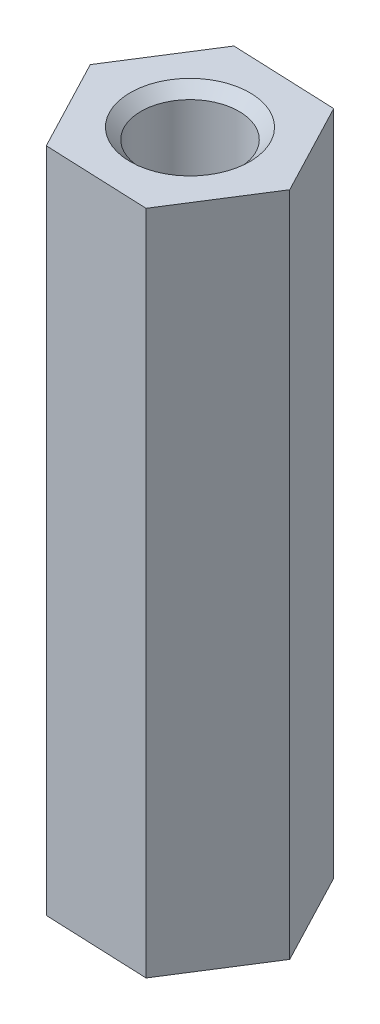
ISO-10303-21;
HEADER;
FILE_DESCRIPTION(('STEP AP214'),'2;1');
FILE_NAME('part.step','',(''),(''),'','','');
FILE_SCHEMA(('AUTOMOTIVE_DESIGN { 1 0 10303 214 1 1 1 1 }'));
ENDSEC;
DATA;
#1=APPLICATION_CONTEXT('core data for automotive mechanical design processes');
#2=APPLICATION_PROTOCOL_DEFINITION('international standard','automotive_design',2000,#1);
#3=PRODUCT_CONTEXT('',#1,'mechanical');
#4=PRODUCT('Part','Part','',(#3));
#5=PRODUCT_RELATED_PRODUCT_CATEGORY('part','',(#4));
#6=PRODUCT_DEFINITION_FORMATION('','',#4);
#7=PRODUCT_DEFINITION_CONTEXT('part definition',#1,'design');
#8=PRODUCT_DEFINITION('design','',#6,#7);
#9=PRODUCT_DEFINITION_SHAPE('','',#8);
#10=(LENGTH_UNIT() NAMED_UNIT(*) SI_UNIT(.MILLI.,.METRE.));
#11=(NAMED_UNIT(*) PLANE_ANGLE_UNIT() SI_UNIT($,.RADIAN.));
#12=(NAMED_UNIT(*) SI_UNIT($,.STERADIAN.) SOLID_ANGLE_UNIT());
#13=UNCERTAINTY_MEASURE_WITH_UNIT(LENGTH_MEASURE(1.E-05),#10,'distance_accuracy_value','');
#14=(GEOMETRIC_REPRESENTATION_CONTEXT(3) GLOBAL_UNCERTAINTY_ASSIGNED_CONTEXT((#13)) GLOBAL_UNIT_ASSIGNED_CONTEXT((#10,
#11,#12)) REPRESENTATION_CONTEXT('',''));
#15=CARTESIAN_POINT('',(0.,0.,0.));
#16=DIRECTION('',(0.,0.,1.));
#17=DIRECTION('',(1.,0.,0.));
#18=AXIS2_PLACEMENT_3D('',#15,#16,#17);
#19=CARTESIAN_POINT('',(0.,17.,0.));
#20=DIRECTION('',(0.,1.,0.));
#21=DIRECTION('',(0.,0.,1.));
#22=AXIS2_PLACEMENT_3D('',#19,#20,#21);
#23=PLANE('',#22);
#24=CARTESIAN_POINT('',(0.,17.,0.));
#25=DIRECTION('',(0.,1.,0.));
#26=DIRECTION('',(0.,0.,1.));
#27=AXIS2_PLACEMENT_3D('',#24,#25,#26);
#28=CIRCLE('',#27,1.525);
#29=CARTESIAN_POINT('',(0.,17.,1.525));
#30=VERTEX_POINT('',#29);
#31=EDGE_CURVE('E197',#30,#30,#28,.T.);
#32=ORIENTED_EDGE('',*,*,#31,.F.);
#33=EDGE_LOOP('',(#32));
#34=FACE_BOUND('',#33,.T.);
#35=DIRECTION('',(0.999145776971958,0.,0.0413245249107971));
#36=VECTOR('',#35,1.);
#37=CARTESIAN_POINT('',(-1.42181769887204,17.,2.24316021819832));
#38=LINE('',#37,#36);
#39=CARTESIAN_POINT('',(-1.42181769887204,17.,2.24316021819832));
#40=VERTEX_POINT('',#39);
#41=CARTESIAN_POINT('',(1.23172488428237,17.,2.35291035587268));
#42=VERTEX_POINT('',#41);
#43=EDGE_CURVE('E149',#40,#42,#38,.T.);
#44=ORIENTED_EDGE('',*,*,#43,.T.);
#45=DIRECTION('',(0.535360976858052,0.,-0.844623362486258));
#46=VECTOR('',#45,1.);
#47=CARTESIAN_POINT('',(1.23172488428237,17.,2.35291035587268));
#48=LINE('',#47,#46);
#49=CARTESIAN_POINT('',(2.65354258315441,17.,0.109750137674357));
#50=VERTEX_POINT('',#49);
#51=EDGE_CURVE('E98',#42,#50,#48,.T.);
#52=ORIENTED_EDGE('',*,*,#51,.T.);
#53=DIRECTION('',(-0.463784800113906,0.,-0.885947887397055));
#54=VECTOR('',#53,1.);
#55=CARTESIAN_POINT('',(2.65354258315441,17.,0.109750137674357));
#56=LINE('',#55,#54);
#57=CARTESIAN_POINT('',(1.42181769887204,17.,-2.24316021819832));
#58=VERTEX_POINT('',#57);
#59=EDGE_CURVE('E110',#50,#58,#56,.T.);
#60=ORIENTED_EDGE('',*,*,#59,.T.);
#61=DIRECTION('',(-0.999145776971957,0.,-0.0413245249107969));
#62=VECTOR('',#61,1.);
#63=CARTESIAN_POINT('',(1.42181769887204,17.,-2.24316021819832));
#64=LINE('',#63,#62);
#65=CARTESIAN_POINT('',(-1.23172488428237,17.,-2.35291035587268));
#66=VERTEX_POINT('',#65);
#67=EDGE_CURVE('E105',#58,#66,#64,.T.);
#68=ORIENTED_EDGE('',*,*,#67,.T.);
#69=DIRECTION('',(-0.535360976858052,0.,0.844623362486258));
#70=VECTOR('',#69,1.);
#71=CARTESIAN_POINT('',(-1.23172488428237,17.,-2.35291035587268));
#72=LINE('',#71,#70);
#73=CARTESIAN_POINT('',(-2.65354258315441,17.,-0.109750137674357));
#74=VERTEX_POINT('',#73);
#75=EDGE_CURVE('E108',#66,#74,#72,.T.);
#76=ORIENTED_EDGE('',*,*,#75,.T.);
#77=DIRECTION('',(0.463784800113906,0.,0.885947887397055));
#78=VECTOR('',#77,1.);
#79=CARTESIAN_POINT('',(-2.65354258315441,17.,-0.109750137674357));
#80=LINE('',#79,#78);
#81=EDGE_CURVE('E61',#74,#40,#80,.T.);
#82=ORIENTED_EDGE('',*,*,#81,.T.);
#83=EDGE_LOOP('',(#44,#52,#60,#68,#76,#82));
#84=FACE_BOUND('',#83,.T.);
#85=ADVANCED_FACE('F43',(#34,#84),#23,.T.);
#86=CARTESIAN_POINT('',(0.,0.,0.));
#87=DIRECTION('',(0.,1.,0.));
#88=DIRECTION('',(0.,0.,1.));
#89=AXIS2_PLACEMENT_3D('',#86,#87,#88);
#90=PLANE('',#89);
#91=CARTESIAN_POINT('',(0.,0.,0.));
#92=DIRECTION('',(0.,1.,0.));
#93=DIRECTION('',(0.,0.,1.));
#94=AXIS2_PLACEMENT_3D('',#91,#92,#93);
#95=CIRCLE('',#94,1.25);
#96=CARTESIAN_POINT('',(0.,0.,1.25));
#97=VERTEX_POINT('',#96);
#98=EDGE_CURVE('E137',#97,#97,#95,.T.);
#99=ORIENTED_EDGE('',*,*,#98,.T.);
#100=EDGE_LOOP('',(#99));
#101=FACE_BOUND('',#100,.T.);
#102=DIRECTION('',(0.999145776971958,0.,0.0413245249107971));
#103=VECTOR('',#102,1.);
#104=CARTESIAN_POINT('',(-1.42181769887204,0.,2.24316021819832));
#105=LINE('',#104,#103);
#106=CARTESIAN_POINT('',(-1.42181769887204,0.,2.24316021819832));
#107=VERTEX_POINT('',#106);
#108=CARTESIAN_POINT('',(1.23172488428237,0.,2.35291035587268));
#109=VERTEX_POINT('',#108);
#110=EDGE_CURVE('E132',#107,#109,#105,.T.);
#111=ORIENTED_EDGE('',*,*,#110,.F.);
#112=DIRECTION('',(0.463784800113906,0.,0.885947887397055));
#113=VECTOR('',#112,1.);
#114=CARTESIAN_POINT('',(-2.65354258315441,0.,-0.109750137674357));
#115=LINE('',#114,#113);
#116=CARTESIAN_POINT('',(-2.65354258315441,0.,-0.109750137674357));
#117=VERTEX_POINT('',#116);
#118=EDGE_CURVE('E90',#117,#107,#115,.T.);
#119=ORIENTED_EDGE('',*,*,#118,.F.);
#120=DIRECTION('',(-0.535360976858052,0.,0.844623362486258));
#121=VECTOR('',#120,1.);
#122=CARTESIAN_POINT('',(-1.23172488428237,0.,-2.35291035587268));
#123=LINE('',#122,#121);
#124=CARTESIAN_POINT('',(-1.23172488428237,0.,-2.35291035587268));
#125=VERTEX_POINT('',#124);
#126=EDGE_CURVE('E84',#125,#117,#123,.T.);
#127=ORIENTED_EDGE('',*,*,#126,.F.);
#128=DIRECTION('',(-0.999145776971957,0.,-0.0413245249107969));
#129=VECTOR('',#128,1.);
#130=CARTESIAN_POINT('',(1.42181769887204,0.,-2.24316021819832));
#131=LINE('',#130,#129);
#132=CARTESIAN_POINT('',(1.42181769887204,0.,-2.24316021819832));
#133=VERTEX_POINT('',#132);
#134=EDGE_CURVE('E119',#133,#125,#131,.T.);
#135=ORIENTED_EDGE('',*,*,#134,.F.);
#136=DIRECTION('',(-0.463784800113906,0.,-0.885947887397055));
#137=VECTOR('',#136,1.);
#138=CARTESIAN_POINT('',(2.65354258315441,0.,0.109750137674357));
#139=LINE('',#138,#137);
#140=CARTESIAN_POINT('',(2.65354258315441,0.,0.109750137674357));
#141=VERTEX_POINT('',#140);
#142=EDGE_CURVE('E140',#141,#133,#139,.T.);
#143=ORIENTED_EDGE('',*,*,#142,.F.);
#144=DIRECTION('',(0.535360976858052,0.,-0.844623362486258));
#145=VECTOR('',#144,1.);
#146=CARTESIAN_POINT('',(1.23172488428237,0.,2.35291035587268));
#147=LINE('',#146,#145);
#148=EDGE_CURVE('E136',#109,#141,#147,.T.);
#149=ORIENTED_EDGE('',*,*,#148,.F.);
#150=EDGE_LOOP('',(#111,#119,#127,#135,#143,#149));
#151=FACE_BOUND('',#150,.T.);
#152=ADVANCED_FACE('F162',(#101,#151),#90,.F.);
#153=CARTESIAN_POINT('',(-1.42181769887204,17.,2.24316021819832));
#154=DIRECTION('',(0.0413245249107971,0.,-0.999145776971958));
#155=DIRECTION('',(-0.999145776971958,0.,-0.0413245249107971));
#156=AXIS2_PLACEMENT_3D('',#153,#154,#155);
#157=PLANE('',#156);
#158=ORIENTED_EDGE('',*,*,#110,.T.);
#159=DIRECTION('',(0.,-1.,0.));
#160=VECTOR('',#159,1.);
#161=CARTESIAN_POINT('',(1.23172488428237,17.,2.35291035587268));
#162=LINE('',#161,#160);
#163=EDGE_CURVE('E11',#42,#109,#162,.T.);
#164=ORIENTED_EDGE('',*,*,#163,.F.);
#165=ORIENTED_EDGE('',*,*,#43,.F.);
#166=DIRECTION('',(0.,-1.,0.));
#167=VECTOR('',#166,1.);
#168=CARTESIAN_POINT('',(-1.42181769887204,17.,2.24316021819832));
#169=LINE('',#168,#167);
#170=EDGE_CURVE('E128',#40,#107,#169,.T.);
#171=ORIENTED_EDGE('',*,*,#170,.T.);
#172=EDGE_LOOP('',(#158,#164,#165,#171));
#173=FACE_BOUND('',#172,.T.);
#174=ADVANCED_FACE('F45',(#173),#157,.F.);
#175=CARTESIAN_POINT('',(1.23172488428237,17.,2.35291035587268));
#176=DIRECTION('',(-0.844623362486258,0.,-0.535360976858052));
#177=DIRECTION('',(-0.535360976858052,0.,0.844623362486258));
#178=AXIS2_PLACEMENT_3D('',#175,#176,#177);
#179=PLANE('',#178);
#180=ORIENTED_EDGE('',*,*,#148,.T.);
#181=DIRECTION('',(0.,-1.,0.));
#182=VECTOR('',#181,1.);
#183=CARTESIAN_POINT('',(2.65354258315441,17.,0.109750137674357));
#184=LINE('',#183,#182);
#185=EDGE_CURVE('E53',#50,#141,#184,.T.);
#186=ORIENTED_EDGE('',*,*,#185,.F.);
#187=ORIENTED_EDGE('',*,*,#51,.F.);
#188=ORIENTED_EDGE('',*,*,#163,.T.);
#189=EDGE_LOOP('',(#180,#186,#187,#188));
#190=FACE_BOUND('',#189,.T.);
#191=ADVANCED_FACE('F263',(#190),#179,.F.);
#192=CARTESIAN_POINT('',(2.65354258315441,17.,0.109750137674357));
#193=DIRECTION('',(-0.885947887397055,0.,0.463784800113906));
#194=DIRECTION('',(0.463784800113906,0.,0.885947887397055));
#195=AXIS2_PLACEMENT_3D('',#192,#193,#194);
#196=PLANE('',#195);
#197=ORIENTED_EDGE('',*,*,#142,.T.);
#198=DIRECTION('',(0.,-1.,0.));
#199=VECTOR('',#198,1.);
#200=CARTESIAN_POINT('',(1.42181769887204,17.,-2.24316021819832));
#201=LINE('',#200,#199);
#202=EDGE_CURVE('E121',#58,#133,#201,.T.);
#203=ORIENTED_EDGE('',*,*,#202,.F.);
#204=ORIENTED_EDGE('',*,*,#59,.F.);
#205=ORIENTED_EDGE('',*,*,#185,.T.);
#206=EDGE_LOOP('',(#197,#203,#204,#205));
#207=FACE_BOUND('',#206,.T.);
#208=ADVANCED_FACE('F159',(#207),#196,.F.);
#209=CARTESIAN_POINT('',(1.42181769887204,17.,-2.24316021819832));
#210=DIRECTION('',(-0.0413245249107969,0.,0.999145776971958));
#211=DIRECTION('',(0.999145776971958,0.,0.041324524910797));
#212=AXIS2_PLACEMENT_3D('',#209,#210,#211);
#213=PLANE('',#212);
#214=ORIENTED_EDGE('',*,*,#134,.T.);
#215=DIRECTION('',(0.,-1.,0.));
#216=VECTOR('',#215,1.);
#217=CARTESIAN_POINT('',(-1.23172488428237,17.,-2.35291035587268));
#218=LINE('',#217,#216);
#219=EDGE_CURVE('E116',#66,#125,#218,.T.);
#220=ORIENTED_EDGE('',*,*,#219,.F.);
#221=ORIENTED_EDGE('',*,*,#67,.F.);
#222=ORIENTED_EDGE('',*,*,#202,.T.);
#223=EDGE_LOOP('',(#214,#220,#221,#222));
#224=FACE_BOUND('',#223,.T.);
#225=ADVANCED_FACE('F117',(#224),#213,.F.);
#226=CARTESIAN_POINT('',(-1.23172488428237,17.,-2.35291035587268));
#227=DIRECTION('',(0.844623362486258,0.,0.535360976858052));
#228=DIRECTION('',(0.535360976858052,0.,-0.844623362486258));
#229=AXIS2_PLACEMENT_3D('',#226,#227,#228);
#230=PLANE('',#229);
#231=ORIENTED_EDGE('',*,*,#126,.T.);
#232=DIRECTION('',(0.,-1.,0.));
#233=VECTOR('',#232,1.);
#234=CARTESIAN_POINT('',(-2.65354258315441,17.,-0.109750137674357));
#235=LINE('',#234,#233);
#236=EDGE_CURVE('E122',#74,#117,#235,.T.);
#237=ORIENTED_EDGE('',*,*,#236,.F.);
#238=ORIENTED_EDGE('',*,*,#75,.F.);
#239=ORIENTED_EDGE('',*,*,#219,.T.);
#240=EDGE_LOOP('',(#231,#237,#238,#239));
#241=FACE_BOUND('',#240,.T.);
#242=ADVANCED_FACE('F124',(#241),#230,.F.);
#243=CARTESIAN_POINT('',(-2.65354258315441,17.,-0.109750137674357));
#244=DIRECTION('',(0.885947887397055,0.,-0.463784800113906));
#245=DIRECTION('',(-0.463784800113906,0.,-0.885947887397055));
#246=AXIS2_PLACEMENT_3D('',#243,#244,#245);
#247=PLANE('',#246);
#248=ORIENTED_EDGE('',*,*,#118,.T.);
#249=ORIENTED_EDGE('',*,*,#170,.F.);
#250=ORIENTED_EDGE('',*,*,#81,.F.);
#251=ORIENTED_EDGE('',*,*,#236,.T.);
#252=EDGE_LOOP('',(#248,#249,#250,#251));
#253=FACE_BOUND('',#252,.T.);
#254=ADVANCED_FACE('F166',(#253),#247,.F.);
#255=CARTESIAN_POINT('',(0.,17.,0.));
#256=DIRECTION('',(0.,1.,0.));
#257=DIRECTION('',(0.,0.,1.));
#258=AXIS2_PLACEMENT_3D('',#255,#256,#257);
#259=CYLINDRICAL_SURFACE('',#258,1.25);
#260=ORIENTED_EDGE('',*,*,#98,.F.);
#261=EDGE_LOOP('',(#260));
#262=FACE_BOUND('',#261,.T.);
#263=CARTESIAN_POINT('',(0.,16.725,0.));
#264=DIRECTION('',(0.,1.,0.));
#265=DIRECTION('',(0.,0.,1.));
#266=AXIS2_PLACEMENT_3D('',#263,#264,#265);
#267=CIRCLE('',#266,1.25);
#268=CARTESIAN_POINT('',(0.,16.725,1.25));
#269=VERTEX_POINT('',#268);
#270=EDGE_CURVE('E195',#269,#269,#267,.T.);
#271=ORIENTED_EDGE('',*,*,#270,.T.);
#272=EDGE_LOOP('',(#271));
#273=FACE_BOUND('',#272,.T.);
#274=ADVANCED_FACE('F168',(#262,#273),#259,.F.);
#275=CARTESIAN_POINT('',(0.,17.,0.));
#276=DIRECTION('',(0.,1.,0.));
#277=DIRECTION('',(0.,0.,1.));
#278=AXIS2_PLACEMENT_3D('',#275,#276,#277);
#279=CONICAL_SURFACE('',#278,1.525,0.785398163397445);
#280=ORIENTED_EDGE('',*,*,#270,.F.);
#281=EDGE_LOOP('',(#280));
#282=FACE_BOUND('',#281,.T.);
#283=ORIENTED_EDGE('',*,*,#31,.T.);
#284=EDGE_LOOP('',(#283));
#285=FACE_BOUND('',#284,.T.);
#286=ADVANCED_FACE('F174',(#282,#285),#279,.F.);
#287=CLOSED_SHELL('',(#85,#152,#174,#191,#208,#225,#242,#254,#274,#286));
#288=MANIFOLD_SOLID_BREP('B2',#287);
#289=ADVANCED_BREP_SHAPE_REPRESENTATION('',(#18,#288),#14);
#290=SHAPE_DEFINITION_REPRESENTATION(#9,#289);
ENDSEC;
END-ISO-10303-21;
